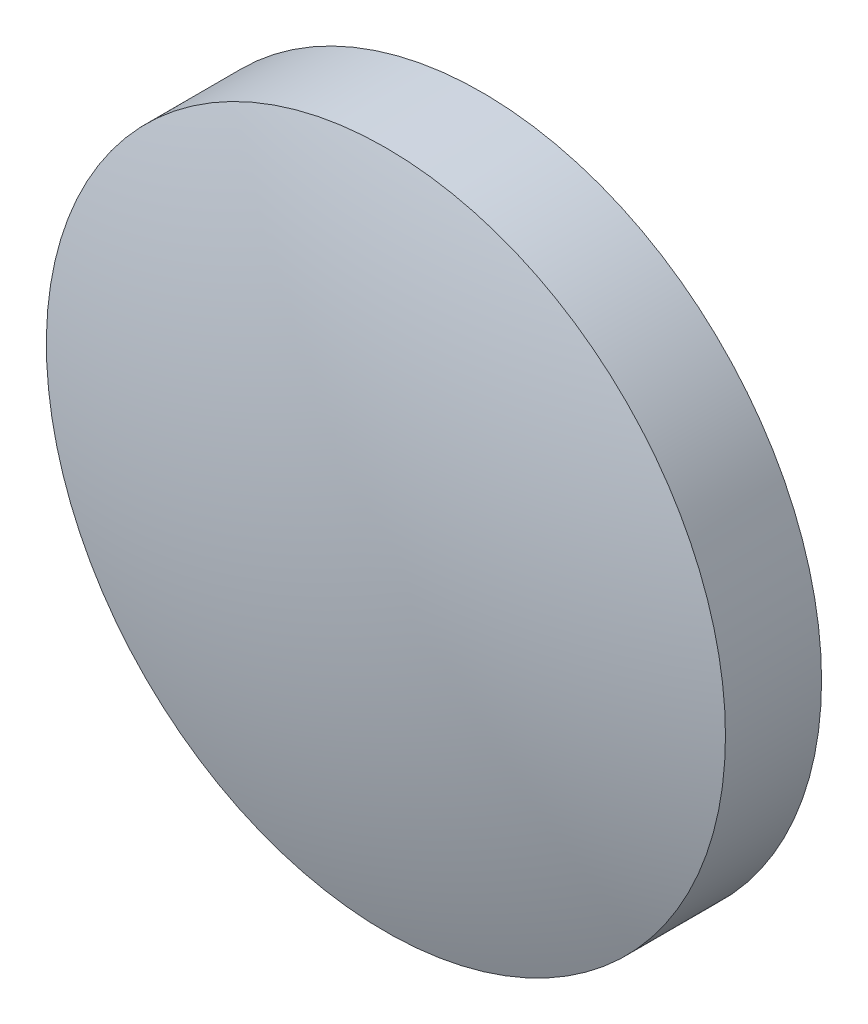
ISO-10303-21;
HEADER;
FILE_DESCRIPTION(('STEP AP214'),'2;1');
FILE_NAME('part.step','',(''),(''),'','','');
FILE_SCHEMA(('AUTOMOTIVE_DESIGN { 1 0 10303 214 1 1 1 1 }'));
ENDSEC;
DATA;
#1=APPLICATION_CONTEXT('core data for automotive mechanical design processes');
#2=APPLICATION_PROTOCOL_DEFINITION('international standard','automotive_design',2000,#1);
#3=PRODUCT_CONTEXT('',#1,'mechanical');
#4=PRODUCT('Part','Part','',(#3));
#5=PRODUCT_RELATED_PRODUCT_CATEGORY('part','',(#4));
#6=PRODUCT_DEFINITION_FORMATION('','',#4);
#7=PRODUCT_DEFINITION_CONTEXT('part definition',#1,'design');
#8=PRODUCT_DEFINITION('design','',#6,#7);
#9=PRODUCT_DEFINITION_SHAPE('','',#8);
#10=(LENGTH_UNIT() NAMED_UNIT(*) SI_UNIT(.MILLI.,.METRE.));
#11=(NAMED_UNIT(*) PLANE_ANGLE_UNIT() SI_UNIT($,.RADIAN.));
#12=(NAMED_UNIT(*) SI_UNIT($,.STERADIAN.) SOLID_ANGLE_UNIT());
#13=UNCERTAINTY_MEASURE_WITH_UNIT(LENGTH_MEASURE(1.E-05),#10,'distance_accuracy_value','');
#14=(GEOMETRIC_REPRESENTATION_CONTEXT(3) GLOBAL_UNCERTAINTY_ASSIGNED_CONTEXT((#13)) GLOBAL_UNIT_ASSIGNED_CONTEXT((#10,
#11,#12)) REPRESENTATION_CONTEXT('',''));
#15=CARTESIAN_POINT('',(0.,0.,0.));
#16=DIRECTION('',(0.,0.,1.));
#17=DIRECTION('',(1.,0.,0.));
#18=AXIS2_PLACEMENT_3D('',#15,#16,#17);
#19=CARTESIAN_POINT('',(0.,0.,-19.2));
#20=DIRECTION('',(0.,0.,1.));
#21=DIRECTION('',(0.,1.,0.));
#22=AXIS2_PLACEMENT_3D('',#19,#20,#21);
#23=SPHERICAL_SURFACE('',#22,20.6);
#24=CARTESIAN_POINT('',(0.,0.,0.396874750837183));
#25=DIRECTION('',(0.,0.,1.));
#26=DIRECTION('',(1.,0.,0.));
#27=AXIS2_PLACEMENT_3D('',#24,#25,#26);
#28=CIRCLE('',#27,6.35);
#29=CARTESIAN_POINT('',(6.35,0.,0.396874750837183));
#30=VERTEX_POINT('',#29);
#31=EDGE_CURVE('E8',#30,#30,#28,.T.);
#32=ORIENTED_EDGE('',*,*,#31,.T.);
#33=EDGE_LOOP('',(#32));
#34=FACE_BOUND('',#33,.T.);
#35=ADVANCED_FACE('F12',(#34),#23,.T.);
#36=CARTESIAN_POINT('',(0.,0.,4.30813204540037));
#37=DIRECTION('',(0.,0.,1.));
#38=DIRECTION('',(1.,0.,0.));
#39=AXIS2_PLACEMENT_3D('',#36,#37,#38);
#40=CYLINDRICAL_SURFACE('',#39,6.35);
#41=ORIENTED_EDGE('',*,*,#31,.F.);
#42=EDGE_LOOP('',(#41));
#43=FACE_BOUND('',#42,.T.);
#44=CARTESIAN_POINT('',(0.,0.,-1.4));
#45=DIRECTION('',(0.,0.,1.));
#46=DIRECTION('',(1.,0.,0.));
#47=AXIS2_PLACEMENT_3D('',#44,#45,#46);
#48=CIRCLE('',#47,6.35);
#49=CARTESIAN_POINT('',(6.35,0.,-1.4));
#50=VERTEX_POINT('',#49);
#51=EDGE_CURVE('E18',#50,#50,#48,.T.);
#52=ORIENTED_EDGE('',*,*,#51,.T.);
#53=EDGE_LOOP('',(#52));
#54=FACE_BOUND('',#53,.T.);
#55=ADVANCED_FACE('F24',(#43,#54),#40,.T.);
#56=CARTESIAN_POINT('',(0.,0.,-1.4));
#57=DIRECTION('',(0.,0.,1.));
#58=DIRECTION('',(1.,0.,0.));
#59=AXIS2_PLACEMENT_3D('',#56,#57,#58);
#60=PLANE('',#59);
#61=ORIENTED_EDGE('',*,*,#51,.F.);
#62=EDGE_LOOP('',(#61));
#63=FACE_BOUND('',#62,.T.);
#64=ADVANCED_FACE('F26',(#63),#60,.F.);
#65=CLOSED_SHELL('',(#35,#55,#64));
#66=MANIFOLD_SOLID_BREP('B1',#65);
#67=ADVANCED_BREP_SHAPE_REPRESENTATION('',(#18,#66),#14);
#68=SHAPE_DEFINITION_REPRESENTATION(#9,#67);
ENDSEC;
END-ISO-10303-21;
